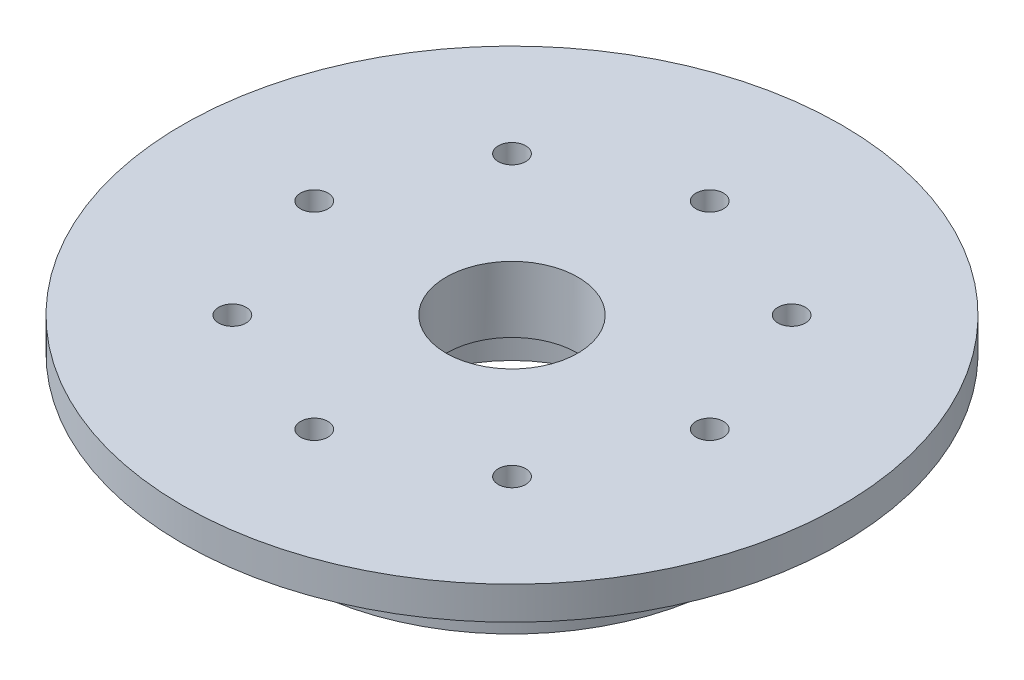
ISO-10303-21;
HEADER;
FILE_DESCRIPTION(('STEP AP214'),'2;1');
FILE_NAME('part.step','',(''),(''),'','','');
FILE_SCHEMA(('AUTOMOTIVE_DESIGN { 1 0 10303 214 1 1 1 1 }'));
ENDSEC;
DATA;
#1=APPLICATION_CONTEXT('core data for automotive mechanical design processes');
#2=APPLICATION_PROTOCOL_DEFINITION('international standard','automotive_design',2000,#1);
#3=PRODUCT_CONTEXT('',#1,'mechanical');
#4=PRODUCT('Part','Part','',(#3));
#5=PRODUCT_RELATED_PRODUCT_CATEGORY('part','',(#4));
#6=PRODUCT_DEFINITION_FORMATION('','',#4);
#7=PRODUCT_DEFINITION_CONTEXT('part definition',#1,'design');
#8=PRODUCT_DEFINITION('design','',#6,#7);
#9=PRODUCT_DEFINITION_SHAPE('','',#8);
#10=(LENGTH_UNIT() NAMED_UNIT(*) SI_UNIT(.MILLI.,.METRE.));
#11=(NAMED_UNIT(*) PLANE_ANGLE_UNIT() SI_UNIT($,.RADIAN.));
#12=(NAMED_UNIT(*) SI_UNIT($,.STERADIAN.) SOLID_ANGLE_UNIT());
#13=UNCERTAINTY_MEASURE_WITH_UNIT(LENGTH_MEASURE(1.E-05),#10,'distance_accuracy_value','');
#14=(GEOMETRIC_REPRESENTATION_CONTEXT(3) GLOBAL_UNCERTAINTY_ASSIGNED_CONTEXT((#13)) GLOBAL_UNIT_ASSIGNED_CONTEXT((#10,
#11,#12)) REPRESENTATION_CONTEXT('',''));
#15=CARTESIAN_POINT('',(0.,0.,0.));
#16=DIRECTION('',(0.,0.,1.));
#17=DIRECTION('',(1.,0.,0.));
#18=AXIS2_PLACEMENT_3D('',#15,#16,#17);
#19=CARTESIAN_POINT('',(0.,-3.,0.));
#20=DIRECTION('',(0.,1.,0.));
#21=DIRECTION('',(0.,0.,1.));
#22=AXIS2_PLACEMENT_3D('',#19,#20,#21);
#23=CYLINDRICAL_SURFACE('',#22,30.);
#24=CARTESIAN_POINT('',(0.,-3.,0.));
#25=DIRECTION('',(0.,1.,0.));
#26=DIRECTION('',(0.,0.,1.));
#27=AXIS2_PLACEMENT_3D('',#24,#25,#26);
#28=CIRCLE('',#27,30.);
#29=CARTESIAN_POINT('',(0.,-3.,30.));
#30=VERTEX_POINT('',#29);
#31=EDGE_CURVE('E72',#30,#30,#28,.T.);
#32=ORIENTED_EDGE('',*,*,#31,.T.);
#33=EDGE_LOOP('',(#32));
#34=FACE_BOUND('',#33,.T.);
#35=CARTESIAN_POINT('',(0.,0.,0.));
#36=DIRECTION('',(0.,1.,0.));
#37=DIRECTION('',(0.,0.,1.));
#38=AXIS2_PLACEMENT_3D('',#35,#36,#37);
#39=CIRCLE('',#38,30.);
#40=CARTESIAN_POINT('',(0.,0.,30.));
#41=VERTEX_POINT('',#40);
#42=EDGE_CURVE('E81',#41,#41,#39,.T.);
#43=ORIENTED_EDGE('',*,*,#42,.F.);
#44=EDGE_LOOP('',(#43));
#45=FACE_BOUND('',#44,.T.);
#46=ADVANCED_FACE('F56',(#34,#45),#23,.T.);
#47=CARTESIAN_POINT('',(0.,-3.,0.));
#48=DIRECTION('',(0.,1.,0.));
#49=DIRECTION('',(0.,0.,1.));
#50=AXIS2_PLACEMENT_3D('',#47,#48,#49);
#51=PLANE('',#50);
#52=CARTESIAN_POINT('',(0.,-3.,0.));
#53=DIRECTION('',(0.,-1.,0.));
#54=DIRECTION('',(0.,0.,-1.));
#55=AXIS2_PLACEMENT_3D('',#52,#53,#54);
#56=CIRCLE('',#55,23.);
#57=CARTESIAN_POINT('',(0.,-3.,-23.));
#58=VERTEX_POINT('',#57);
#59=EDGE_CURVE('E64',#58,#58,#56,.T.);
#60=ORIENTED_EDGE('',*,*,#59,.F.);
#61=EDGE_LOOP('',(#60));
#62=FACE_BOUND('',#61,.T.);
#63=ORIENTED_EDGE('',*,*,#31,.F.);
#64=EDGE_LOOP('',(#63));
#65=FACE_BOUND('',#64,.T.);
#66=ADVANCED_FACE('F234',(#62,#65),#51,.F.);
#67=CARTESIAN_POINT('',(0.,0.,0.));
#68=DIRECTION('',(0.,1.,0.));
#69=DIRECTION('',(0.,0.,1.));
#70=AXIS2_PLACEMENT_3D('',#67,#68,#69);
#71=PLANE('',#70);
#72=CARTESIAN_POINT('',(0.,0.,-18.));
#73=DIRECTION('',(0.,1.,0.));
#74=DIRECTION('',(0.,0.,1.));
#75=AXIS2_PLACEMENT_3D('',#72,#73,#74);
#76=CIRCLE('',#75,1.25);
#77=CARTESIAN_POINT('',(0.,0.,-16.75));
#78=VERTEX_POINT('',#77);
#79=EDGE_CURVE('E144',#78,#78,#76,.T.);
#80=ORIENTED_EDGE('',*,*,#79,.F.);
#81=EDGE_LOOP('',(#80));
#82=FACE_BOUND('',#81,.T.);
#83=CARTESIAN_POINT('',(12.7279220613581,0.,-12.7279220613584));
#84=DIRECTION('',(0.,1.,0.));
#85=DIRECTION('',(0.,0.,1.));
#86=AXIS2_PLACEMENT_3D('',#83,#84,#85);
#87=CIRCLE('',#86,1.25);
#88=CARTESIAN_POINT('',(12.7279220613581,0.,-11.4779220613584));
#89=VERTEX_POINT('',#88);
#90=EDGE_CURVE('E127',#89,#89,#87,.T.);
#91=ORIENTED_EDGE('',*,*,#90,.F.);
#92=EDGE_LOOP('',(#91));
#93=FACE_BOUND('',#92,.T.);
#94=CARTESIAN_POINT('',(18.0000000000008,0.,-7.6407960826321E-13));
#95=DIRECTION('',(0.,1.,0.));
#96=DIRECTION('',(0.,0.,1.));
#97=AXIS2_PLACEMENT_3D('',#94,#95,#96);
#98=CIRCLE('',#97,1.25);
#99=CARTESIAN_POINT('',(18.0000000000008,0.,1.24999999999923));
#100=VERTEX_POINT('',#99);
#101=EDGE_CURVE('E123',#100,#100,#98,.T.);
#102=ORIENTED_EDGE('',*,*,#101,.F.);
#103=EDGE_LOOP('',(#102));
#104=FACE_BOUND('',#103,.T.);
#105=CARTESIAN_POINT('',(12.7279220613592,0.,12.7279220613573));
#106=DIRECTION('',(0.,1.,0.));
#107=DIRECTION('',(0.,0.,1.));
#108=AXIS2_PLACEMENT_3D('',#105,#106,#107);
#109=CIRCLE('',#108,1.25);
#110=CARTESIAN_POINT('',(12.7279220613592,0.,13.9779220613573));
#111=VERTEX_POINT('',#110);
#112=EDGE_CURVE('E119',#111,#111,#109,.T.);
#113=ORIENTED_EDGE('',*,*,#112,.F.);
#114=EDGE_LOOP('',(#113));
#115=FACE_BOUND('',#114,.T.);
#116=CARTESIAN_POINT('',(1.52295592540262E-12,0.,18.));
#117=DIRECTION('',(0.,1.,0.));
#118=DIRECTION('',(0.,0.,1.));
#119=AXIS2_PLACEMENT_3D('',#116,#117,#118);
#120=CIRCLE('',#119,1.25);
#121=CARTESIAN_POINT('',(1.52295592540262E-12,0.,19.25));
#122=VERTEX_POINT('',#121);
#123=EDGE_CURVE('E114',#122,#122,#120,.T.);
#124=ORIENTED_EDGE('',*,*,#123,.F.);
#125=EDGE_LOOP('',(#124));
#126=FACE_BOUND('',#125,.T.);
#127=CARTESIAN_POINT('',(-12.7279220613566,0.,12.7279220613584));
#128=DIRECTION('',(0.,1.,0.));
#129=DIRECTION('',(0.,0.,1.));
#130=AXIS2_PLACEMENT_3D('',#127,#128,#129);
#131=CIRCLE('',#130,1.25);
#132=CARTESIAN_POINT('',(-12.7279220613566,0.,13.9779220613584));
#133=VERTEX_POINT('',#132);
#134=EDGE_CURVE('E109',#133,#133,#131,.T.);
#135=ORIENTED_EDGE('',*,*,#134,.F.);
#136=EDGE_LOOP('',(#135));
#137=FACE_BOUND('',#136,.T.);
#138=CARTESIAN_POINT('',(-17.9999999999992,0.,7.66283972501676E-13));
#139=DIRECTION('',(0.,1.,0.));
#140=DIRECTION('',(0.,0.,1.));
#141=AXIS2_PLACEMENT_3D('',#138,#139,#140);
#142=CIRCLE('',#141,1.25);
#143=CARTESIAN_POINT('',(-17.9999999999992,0.,1.25000000000076));
#144=VERTEX_POINT('',#143);
#145=EDGE_CURVE('E104',#144,#144,#142,.T.);
#146=ORIENTED_EDGE('',*,*,#145,.F.);
#147=EDGE_LOOP('',(#146));
#148=FACE_BOUND('',#147,.T.);
#149=CARTESIAN_POINT('',(-12.7279220613576,0.,-12.7279220613573));
#150=DIRECTION('',(0.,1.,0.));
#151=DIRECTION('',(0.,0.,1.));
#152=AXIS2_PLACEMENT_3D('',#149,#150,#151);
#153=CIRCLE('',#152,1.25);
#154=CARTESIAN_POINT('',(-12.7279220613576,0.,-11.4779220613573));
#155=VERTEX_POINT('',#154);
#156=EDGE_CURVE('E99',#155,#155,#153,.T.);
#157=ORIENTED_EDGE('',*,*,#156,.F.);
#158=EDGE_LOOP('',(#157));
#159=FACE_BOUND('',#158,.T.);
#160=CARTESIAN_POINT('',(0.,0.,0.));
#161=DIRECTION('',(0.,1.,0.));
#162=DIRECTION('',(0.,0.,1.));
#163=AXIS2_PLACEMENT_3D('',#160,#161,#162);
#164=CIRCLE('',#163,6.);
#165=CARTESIAN_POINT('',(0.,0.,6.));
#166=VERTEX_POINT('',#165);
#167=EDGE_CURVE('E94',#166,#166,#164,.T.);
#168=ORIENTED_EDGE('',*,*,#167,.F.);
#169=EDGE_LOOP('',(#168));
#170=FACE_BOUND('',#169,.T.);
#171=ORIENTED_EDGE('',*,*,#42,.T.);
#172=EDGE_LOOP('',(#171));
#173=FACE_BOUND('',#172,.T.);
#174=ADVANCED_FACE('F230',(#82,#93,#104,#115,#126,#137,#148,#159,#170,#173),#71,.T.);
#175=CARTESIAN_POINT('',(0.,-4.,0.));
#176=DIRECTION('',(0.,1.,0.));
#177=DIRECTION('',(0.,0.,1.));
#178=AXIS2_PLACEMENT_3D('',#175,#176,#177);
#179=CYLINDRICAL_SURFACE('',#178,23.);
#180=CARTESIAN_POINT('',(0.,-4.,0.));
#181=DIRECTION('',(0.,-1.,0.));
#182=DIRECTION('',(0.,0.,-1.));
#183=AXIS2_PLACEMENT_3D('',#180,#181,#182);
#184=CIRCLE('',#183,23.);
#185=CARTESIAN_POINT('',(0.,-4.,-23.));
#186=VERTEX_POINT('',#185);
#187=EDGE_CURVE('E78',#186,#186,#184,.T.);
#188=ORIENTED_EDGE('',*,*,#187,.F.);
#189=EDGE_LOOP('',(#188));
#190=FACE_BOUND('',#189,.T.);
#191=ORIENTED_EDGE('',*,*,#59,.T.);
#192=EDGE_LOOP('',(#191));
#193=FACE_BOUND('',#192,.T.);
#194=ADVANCED_FACE('F233',(#190,#193),#179,.T.);
#195=CARTESIAN_POINT('',(0.,-4.,0.));
#196=DIRECTION('',(0.,-1.,0.));
#197=DIRECTION('',(0.,0.,-1.));
#198=AXIS2_PLACEMENT_3D('',#195,#196,#197);
#199=PLANE('',#198);
#200=CARTESIAN_POINT('',(0.,-4.,0.));
#201=DIRECTION('',(0.,-1.,0.));
#202=DIRECTION('',(0.,0.,-1.));
#203=AXIS2_PLACEMENT_3D('',#200,#201,#202);
#204=CIRCLE('',#203,20.);
#205=CARTESIAN_POINT('',(0.,-4.,-20.));
#206=VERTEX_POINT('',#205);
#207=EDGE_CURVE('E12',#206,#206,#204,.T.);
#208=ORIENTED_EDGE('',*,*,#207,.F.);
#209=EDGE_LOOP('',(#208));
#210=FACE_BOUND('',#209,.T.);
#211=ORIENTED_EDGE('',*,*,#187,.T.);
#212=EDGE_LOOP('',(#211));
#213=FACE_BOUND('',#212,.T.);
#214=ADVANCED_FACE('F267',(#210,#213),#199,.T.);
#215=CARTESIAN_POINT('',(0.,-11.,0.));
#216=DIRECTION('',(0.,1.,0.));
#217=DIRECTION('',(0.,0.,1.));
#218=AXIS2_PLACEMENT_3D('',#215,#216,#217);
#219=CYLINDRICAL_SURFACE('',#218,20.);
#220=CARTESIAN_POINT('',(0.,-11.,0.));
#221=DIRECTION('',(0.,-1.,0.));
#222=DIRECTION('',(0.,0.,-1.));
#223=AXIS2_PLACEMENT_3D('',#220,#221,#222);
#224=CIRCLE('',#223,20.);
#225=CARTESIAN_POINT('',(0.,-11.,-20.));
#226=VERTEX_POINT('',#225);
#227=EDGE_CURVE('E76',#226,#226,#224,.T.);
#228=ORIENTED_EDGE('',*,*,#227,.F.);
#229=EDGE_LOOP('',(#228));
#230=FACE_BOUND('',#229,.T.);
#231=ORIENTED_EDGE('',*,*,#207,.T.);
#232=EDGE_LOOP('',(#231));
#233=FACE_BOUND('',#232,.T.);
#234=ADVANCED_FACE('F179',(#230,#233),#219,.T.);
#235=CARTESIAN_POINT('',(0.,-11.,0.));
#236=DIRECTION('',(0.,-1.,0.));
#237=DIRECTION('',(0.,0.,-1.));
#238=AXIS2_PLACEMENT_3D('',#235,#236,#237);
#239=PLANE('',#238);
#240=CARTESIAN_POINT('',(0.,-11.,-18.));
#241=DIRECTION('',(0.,-1.,0.));
#242=DIRECTION('',(0.,0.,-1.));
#243=AXIS2_PLACEMENT_3D('',#240,#241,#242);
#244=CIRCLE('',#243,1.24999999999999);
#245=CARTESIAN_POINT('',(0.,-11.,-19.25));
#246=VERTEX_POINT('',#245);
#247=EDGE_CURVE('E59',#246,#246,#244,.T.);
#248=ORIENTED_EDGE('',*,*,#247,.F.);
#249=EDGE_LOOP('',(#248));
#250=FACE_BOUND('',#249,.T.);
#251=CARTESIAN_POINT('',(12.7279220613581,-11.,-12.7279220613584));
#252=DIRECTION('',(0.,-1.,0.));
#253=DIRECTION('',(0.,0.,-1.));
#254=AXIS2_PLACEMENT_3D('',#251,#252,#253);
#255=CIRCLE('',#254,1.24999999999999);
#256=CARTESIAN_POINT('',(12.7279220613581,-11.,-13.9779220613584));
#257=VERTEX_POINT('',#256);
#258=EDGE_CURVE('E124',#257,#257,#255,.T.);
#259=ORIENTED_EDGE('',*,*,#258,.F.);
#260=EDGE_LOOP('',(#259));
#261=FACE_BOUND('',#260,.T.);
#262=CARTESIAN_POINT('',(18.0000000000008,-11.,-7.6407960826321E-13));
#263=DIRECTION('',(0.,-1.,0.));
#264=DIRECTION('',(0.,0.,-1.));
#265=AXIS2_PLACEMENT_3D('',#262,#263,#264);
#266=CIRCLE('',#265,1.25);
#267=CARTESIAN_POINT('',(18.0000000000008,-11.,-1.25000000000076));
#268=VERTEX_POINT('',#267);
#269=EDGE_CURVE('E120',#268,#268,#266,.T.);
#270=ORIENTED_EDGE('',*,*,#269,.F.);
#271=EDGE_LOOP('',(#270));
#272=FACE_BOUND('',#271,.T.);
#273=CARTESIAN_POINT('',(12.7279220613592,-11.,12.7279220613573));
#274=DIRECTION('',(0.,-1.,0.));
#275=DIRECTION('',(0.,0.,-1.));
#276=AXIS2_PLACEMENT_3D('',#273,#274,#275);
#277=CIRCLE('',#276,1.24999999999999);
#278=CARTESIAN_POINT('',(12.7279220613592,-11.,11.4779220613573));
#279=VERTEX_POINT('',#278);
#280=EDGE_CURVE('E115',#279,#279,#277,.T.);
#281=ORIENTED_EDGE('',*,*,#280,.F.);
#282=EDGE_LOOP('',(#281));
#283=FACE_BOUND('',#282,.T.);
#284=CARTESIAN_POINT('',(1.52295592540262E-12,-11.,18.));
#285=DIRECTION('',(0.,-1.,0.));
#286=DIRECTION('',(0.,0.,-1.));
#287=AXIS2_PLACEMENT_3D('',#284,#285,#286);
#288=CIRCLE('',#287,1.24999999999999);
#289=CARTESIAN_POINT('',(1.52295592540262E-12,-11.,16.75));
#290=VERTEX_POINT('',#289);
#291=EDGE_CURVE('E110',#290,#290,#288,.T.);
#292=ORIENTED_EDGE('',*,*,#291,.F.);
#293=EDGE_LOOP('',(#292));
#294=FACE_BOUND('',#293,.T.);
#295=CARTESIAN_POINT('',(-12.7279220613566,-11.,12.7279220613584));
#296=DIRECTION('',(0.,-1.,0.));
#297=DIRECTION('',(0.,0.,-1.));
#298=AXIS2_PLACEMENT_3D('',#295,#296,#297);
#299=CIRCLE('',#298,1.24999999999999);
#300=CARTESIAN_POINT('',(-12.7279220613566,-11.,11.4779220613584));
#301=VERTEX_POINT('',#300);
#302=EDGE_CURVE('E105',#301,#301,#299,.T.);
#303=ORIENTED_EDGE('',*,*,#302,.F.);
#304=EDGE_LOOP('',(#303));
#305=FACE_BOUND('',#304,.T.);
#306=CARTESIAN_POINT('',(-17.9999999999992,-11.,7.66283972501676E-13));
#307=DIRECTION('',(0.,-1.,0.));
#308=DIRECTION('',(0.,0.,-1.));
#309=AXIS2_PLACEMENT_3D('',#306,#307,#308);
#310=CIRCLE('',#309,1.25);
#311=CARTESIAN_POINT('',(-17.9999999999992,-11.,-1.24999999999923));
#312=VERTEX_POINT('',#311);
#313=EDGE_CURVE('E100',#312,#312,#310,.T.);
#314=ORIENTED_EDGE('',*,*,#313,.F.);
#315=EDGE_LOOP('',(#314));
#316=FACE_BOUND('',#315,.T.);
#317=CARTESIAN_POINT('',(-12.7279220613576,-11.,-12.7279220613573));
#318=DIRECTION('',(0.,-1.,0.));
#319=DIRECTION('',(0.,0.,-1.));
#320=AXIS2_PLACEMENT_3D('',#317,#318,#319);
#321=CIRCLE('',#320,1.24999999999999);
#322=CARTESIAN_POINT('',(-12.7279220613576,-11.,-13.9779220613573));
#323=VERTEX_POINT('',#322);
#324=EDGE_CURVE('E95',#323,#323,#321,.T.);
#325=ORIENTED_EDGE('',*,*,#324,.F.);
#326=EDGE_LOOP('',(#325));
#327=FACE_BOUND('',#326,.T.);
#328=CARTESIAN_POINT('',(0.,-11.,0.));
#329=DIRECTION('',(0.,-1.,0.));
#330=DIRECTION('',(0.,0.,-1.));
#331=AXIS2_PLACEMENT_3D('',#328,#329,#330);
#332=CIRCLE('',#331,10.5);
#333=CARTESIAN_POINT('',(0.,-11.,-10.5));
#334=VERTEX_POINT('',#333);
#335=EDGE_CURVE('E93',#334,#334,#332,.T.);
#336=ORIENTED_EDGE('',*,*,#335,.F.);
#337=EDGE_LOOP('',(#336));
#338=FACE_BOUND('',#337,.T.);
#339=ORIENTED_EDGE('',*,*,#227,.T.);
#340=EDGE_LOOP('',(#339));
#341=FACE_BOUND('',#340,.T.);
#342=ADVANCED_FACE('F176',(#250,#261,#272,#283,#294,#305,#316,#327,#338,#341),#239,.T.);
#343=CARTESIAN_POINT('',(0.,-6.,0.));
#344=DIRECTION('',(0.,-1.,0.));
#345=DIRECTION('',(0.,0.,-1.));
#346=AXIS2_PLACEMENT_3D('',#343,#344,#345);
#347=CYLINDRICAL_SURFACE('',#346,10.5);
#348=CARTESIAN_POINT('',(0.,-6.,0.));
#349=DIRECTION('',(0.,-1.,0.));
#350=DIRECTION('',(0.,0.,-1.));
#351=AXIS2_PLACEMENT_3D('',#348,#349,#350);
#352=CIRCLE('',#351,10.5);
#353=CARTESIAN_POINT('',(0.,-6.,-10.5));
#354=VERTEX_POINT('',#353);
#355=EDGE_CURVE('E165',#354,#354,#352,.T.);
#356=ORIENTED_EDGE('',*,*,#355,.F.);
#357=EDGE_LOOP('',(#356));
#358=FACE_BOUND('',#357,.T.);
#359=ORIENTED_EDGE('',*,*,#335,.T.);
#360=EDGE_LOOP('',(#359));
#361=FACE_BOUND('',#360,.T.);
#362=ADVANCED_FACE('F174',(#358,#361),#347,.F.);
#363=CARTESIAN_POINT('',(0.,-6.,0.));
#364=DIRECTION('',(0.,-1.,0.));
#365=DIRECTION('',(0.,0.,-1.));
#366=AXIS2_PLACEMENT_3D('',#363,#364,#365);
#367=PLANE('',#366);
#368=CARTESIAN_POINT('',(0.,-6.,0.));
#369=DIRECTION('',(0.,-1.,0.));
#370=DIRECTION('',(0.,0.,-1.));
#371=AXIS2_PLACEMENT_3D('',#368,#369,#370);
#372=CIRCLE('',#371,6.);
#373=CARTESIAN_POINT('',(0.,-6.,-6.));
#374=VERTEX_POINT('',#373);
#375=EDGE_CURVE('E89',#374,#374,#372,.T.);
#376=ORIENTED_EDGE('',*,*,#375,.F.);
#377=EDGE_LOOP('',(#376));
#378=FACE_BOUND('',#377,.T.);
#379=ORIENTED_EDGE('',*,*,#355,.T.);
#380=EDGE_LOOP('',(#379));
#381=FACE_BOUND('',#380,.T.);
#382=ADVANCED_FACE('F276',(#378,#381),#367,.T.);
#383=CARTESIAN_POINT('',(0.,-11.,0.));
#384=DIRECTION('',(0.,1.,0.));
#385=DIRECTION('',(0.,0.,1.));
#386=AXIS2_PLACEMENT_3D('',#383,#384,#385);
#387=CYLINDRICAL_SURFACE('',#386,6.);
#388=ORIENTED_EDGE('',*,*,#375,.T.);
#389=EDGE_LOOP('',(#388));
#390=FACE_BOUND('',#389,.T.);
#391=ORIENTED_EDGE('',*,*,#167,.T.);
#392=EDGE_LOOP('',(#391));
#393=FACE_BOUND('',#392,.T.);
#394=ADVANCED_FACE('F280',(#390,#393),#387,.F.);
#395=CARTESIAN_POINT('',(-12.7279220613576,0.,-12.7279220613573));
#396=DIRECTION('',(0.,1.,0.));
#397=DIRECTION('',(0.,0.,1.));
#398=AXIS2_PLACEMENT_3D('',#395,#396,#397);
#399=CYLINDRICAL_SURFACE('',#398,1.24999999999999);
#400=ORIENTED_EDGE('',*,*,#324,.T.);
#401=EDGE_LOOP('',(#400));
#402=FACE_BOUND('',#401,.T.);
#403=ORIENTED_EDGE('',*,*,#156,.T.);
#404=EDGE_LOOP('',(#403));
#405=FACE_BOUND('',#404,.T.);
#406=ADVANCED_FACE('F284',(#402,#405),#399,.F.);
#407=CARTESIAN_POINT('',(-17.9999999999992,0.,7.66283972501676E-13));
#408=DIRECTION('',(0.,1.,0.));
#409=DIRECTION('',(0.,0.,1.));
#410=AXIS2_PLACEMENT_3D('',#407,#408,#409);
#411=CYLINDRICAL_SURFACE('',#410,1.25);
#412=ORIENTED_EDGE('',*,*,#313,.T.);
#413=EDGE_LOOP('',(#412));
#414=FACE_BOUND('',#413,.T.);
#415=ORIENTED_EDGE('',*,*,#145,.T.);
#416=EDGE_LOOP('',(#415));
#417=FACE_BOUND('',#416,.T.);
#418=ADVANCED_FACE('F288',(#414,#417),#411,.F.);
#419=CARTESIAN_POINT('',(-12.7279220613566,0.,12.7279220613584));
#420=DIRECTION('',(0.,1.,0.));
#421=DIRECTION('',(0.,0.,1.));
#422=AXIS2_PLACEMENT_3D('',#419,#420,#421);
#423=CYLINDRICAL_SURFACE('',#422,1.24999999999999);
#424=ORIENTED_EDGE('',*,*,#302,.T.);
#425=EDGE_LOOP('',(#424));
#426=FACE_BOUND('',#425,.T.);
#427=ORIENTED_EDGE('',*,*,#134,.T.);
#428=EDGE_LOOP('',(#427));
#429=FACE_BOUND('',#428,.T.);
#430=ADVANCED_FACE('F292',(#426,#429),#423,.F.);
#431=CARTESIAN_POINT('',(1.52295592540262E-12,0.,18.));
#432=DIRECTION('',(0.,1.,0.));
#433=DIRECTION('',(0.,0.,1.));
#434=AXIS2_PLACEMENT_3D('',#431,#432,#433);
#435=CYLINDRICAL_SURFACE('',#434,1.24999999999999);
#436=ORIENTED_EDGE('',*,*,#291,.T.);
#437=EDGE_LOOP('',(#436));
#438=FACE_BOUND('',#437,.T.);
#439=ORIENTED_EDGE('',*,*,#123,.T.);
#440=EDGE_LOOP('',(#439));
#441=FACE_BOUND('',#440,.T.);
#442=ADVANCED_FACE('F296',(#438,#441),#435,.F.);
#443=CARTESIAN_POINT('',(12.7279220613592,0.,12.7279220613573));
#444=DIRECTION('',(0.,1.,0.));
#445=DIRECTION('',(0.,0.,1.));
#446=AXIS2_PLACEMENT_3D('',#443,#444,#445);
#447=CYLINDRICAL_SURFACE('',#446,1.24999999999999);
#448=ORIENTED_EDGE('',*,*,#280,.T.);
#449=EDGE_LOOP('',(#448));
#450=FACE_BOUND('',#449,.T.);
#451=ORIENTED_EDGE('',*,*,#112,.T.);
#452=EDGE_LOOP('',(#451));
#453=FACE_BOUND('',#452,.T.);
#454=ADVANCED_FACE('F300',(#450,#453),#447,.F.);
#455=CARTESIAN_POINT('',(18.0000000000008,0.,-7.6407960826321E-13));
#456=DIRECTION('',(0.,1.,0.));
#457=DIRECTION('',(0.,0.,1.));
#458=AXIS2_PLACEMENT_3D('',#455,#456,#457);
#459=CYLINDRICAL_SURFACE('',#458,1.25);
#460=ORIENTED_EDGE('',*,*,#269,.T.);
#461=EDGE_LOOP('',(#460));
#462=FACE_BOUND('',#461,.T.);
#463=ORIENTED_EDGE('',*,*,#101,.T.);
#464=EDGE_LOOP('',(#463));
#465=FACE_BOUND('',#464,.T.);
#466=ADVANCED_FACE('F304',(#462,#465),#459,.F.);
#467=CARTESIAN_POINT('',(12.7279220613581,0.,-12.7279220613584));
#468=DIRECTION('',(0.,1.,0.));
#469=DIRECTION('',(0.,0.,1.));
#470=AXIS2_PLACEMENT_3D('',#467,#468,#469);
#471=CYLINDRICAL_SURFACE('',#470,1.24999999999999);
#472=ORIENTED_EDGE('',*,*,#258,.T.);
#473=EDGE_LOOP('',(#472));
#474=FACE_BOUND('',#473,.T.);
#475=ORIENTED_EDGE('',*,*,#90,.T.);
#476=EDGE_LOOP('',(#475));
#477=FACE_BOUND('',#476,.T.);
#478=ADVANCED_FACE('F308',(#474,#477),#471,.F.);
#479=CARTESIAN_POINT('',(0.,0.,-18.));
#480=DIRECTION('',(0.,1.,0.));
#481=DIRECTION('',(0.,0.,1.));
#482=AXIS2_PLACEMENT_3D('',#479,#480,#481);
#483=CYLINDRICAL_SURFACE('',#482,1.24999999999999);
#484=ORIENTED_EDGE('',*,*,#247,.T.);
#485=EDGE_LOOP('',(#484));
#486=FACE_BOUND('',#485,.T.);
#487=ORIENTED_EDGE('',*,*,#79,.T.);
#488=EDGE_LOOP('',(#487));
#489=FACE_BOUND('',#488,.T.);
#490=ADVANCED_FACE('F228',(#486,#489),#483,.F.);
#491=CLOSED_SHELL('',(#46,#66,#174,#194,#214,#234,#342,#362,#382,#394,#406,#418,#430,#442,#454,
#466,#478,#490));
#492=MANIFOLD_SOLID_BREP('B2',#491);
#493=ADVANCED_BREP_SHAPE_REPRESENTATION('',(#18,#492),#14);
#494=SHAPE_DEFINITION_REPRESENTATION(#9,#493);
ENDSEC;
END-ISO-10303-21;
